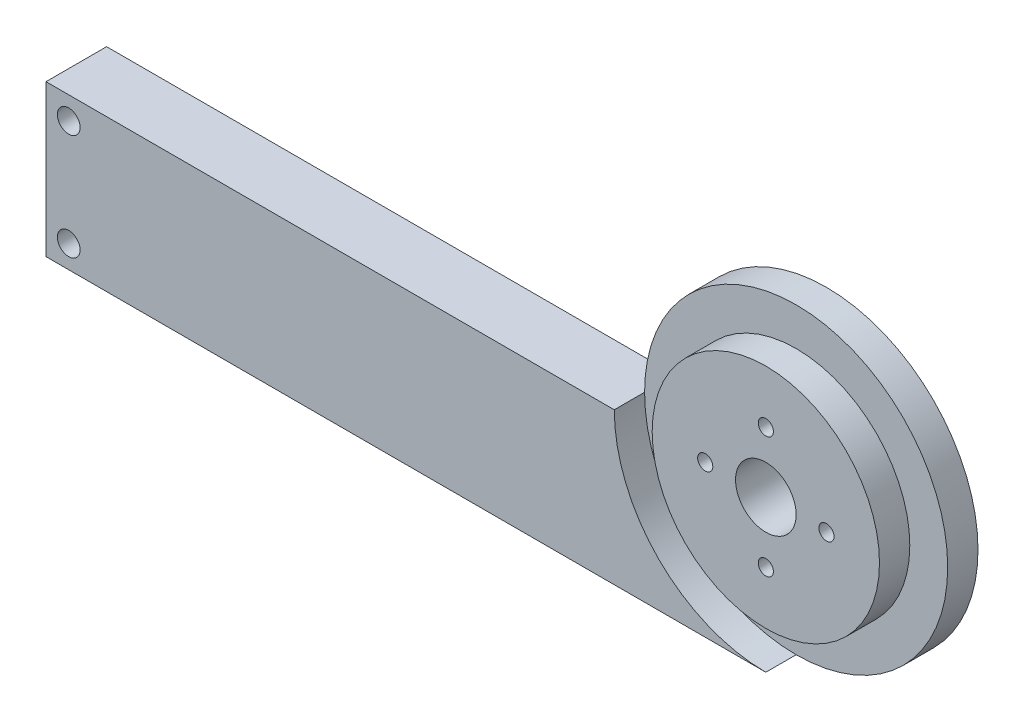
ISO-10303-21;
HEADER;
FILE_DESCRIPTION(('STEP AP214'),'2;1');
FILE_NAME('part.step','',(''),(''),'','','');
FILE_SCHEMA(('AUTOMOTIVE_DESIGN { 1 0 10303 214 1 1 1 1 }'));
ENDSEC;
DATA;
#1=APPLICATION_CONTEXT('core data for automotive mechanical design processes');
#2=APPLICATION_PROTOCOL_DEFINITION('international standard','automotive_design',2000,#1);
#3=PRODUCT_CONTEXT('',#1,'mechanical');
#4=PRODUCT('Part','Part','',(#3));
#5=PRODUCT_RELATED_PRODUCT_CATEGORY('part','',(#4));
#6=PRODUCT_DEFINITION_FORMATION('','',#4);
#7=PRODUCT_DEFINITION_CONTEXT('part definition',#1,'design');
#8=PRODUCT_DEFINITION('design','',#6,#7);
#9=PRODUCT_DEFINITION_SHAPE('','',#8);
#10=(LENGTH_UNIT() NAMED_UNIT(*) SI_UNIT(.MILLI.,.METRE.));
#11=(NAMED_UNIT(*) PLANE_ANGLE_UNIT() SI_UNIT($,.RADIAN.));
#12=(NAMED_UNIT(*) SI_UNIT($,.STERADIAN.) SOLID_ANGLE_UNIT());
#13=UNCERTAINTY_MEASURE_WITH_UNIT(LENGTH_MEASURE(1.E-05),#10,'distance_accuracy_value','');
#14=(GEOMETRIC_REPRESENTATION_CONTEXT(3) GLOBAL_UNCERTAINTY_ASSIGNED_CONTEXT((#13)) GLOBAL_UNIT_ASSIGNED_CONTEXT((#10,
#11,#12)) REPRESENTATION_CONTEXT('',''));
#15=CARTESIAN_POINT('',(0.,0.,0.));
#16=DIRECTION('',(0.,0.,1.));
#17=DIRECTION('',(1.,0.,0.));
#18=AXIS2_PLACEMENT_3D('',#15,#16,#17);
#19=CARTESIAN_POINT('',(32.9922327651456,28.0992721164614,8.));
#20=DIRECTION('',(0.,0.,-1.));
#21=DIRECTION('',(-1.,0.,0.));
#22=AXIS2_PLACEMENT_3D('',#19,#20,#21);
#23=CYLINDRICAL_SURFACE('',#22,20.);
#24=CARTESIAN_POINT('',(32.9922327651456,28.0992721164614,4.));
#25=DIRECTION('',(0.,0.,1.));
#26=DIRECTION('',(1.,0.,0.));
#27=AXIS2_PLACEMENT_3D('',#24,#25,#26);
#28=CIRCLE('',#27,20.);
#29=CARTESIAN_POINT('',(32.9922327651456,8.09927211646137,4.));
#30=VERTEX_POINT('',#29);
#31=CARTESIAN_POINT('',(12.9922327651456,28.0992721164614,4.));
#32=VERTEX_POINT('',#31);
#33=EDGE_CURVE('E124',#30,#32,#28,.T.);
#34=ORIENTED_EDGE('',*,*,#33,.F.);
#35=DIRECTION('',(0.,0.,-1.));
#36=VECTOR('',#35,1.);
#37=CARTESIAN_POINT('',(32.9922327651456,8.09927211646137,8.));
#38=LINE('',#37,#36);
#39=CARTESIAN_POINT('',(32.9922327651456,8.09927211646137,0.));
#40=VERTEX_POINT('',#39);
#41=EDGE_CURVE('E130',#30,#40,#38,.T.);
#42=ORIENTED_EDGE('',*,*,#41,.T.);
#43=CARTESIAN_POINT('',(32.9922327651456,28.0992721164614,0.));
#44=DIRECTION('',(0.,0.,1.));
#45=DIRECTION('',(1.,0.,0.));
#46=AXIS2_PLACEMENT_3D('',#43,#44,#45);
#47=CIRCLE('',#46,20.);
#48=CARTESIAN_POINT('',(12.9922327651456,28.0992721164614,0.));
#49=VERTEX_POINT('',#48);
#50=EDGE_CURVE('E95',#40,#49,#47,.T.);
#51=ORIENTED_EDGE('',*,*,#50,.T.);
#52=DIRECTION('',(0.,0.,-1.));
#53=VECTOR('',#52,1.);
#54=CARTESIAN_POINT('',(12.9922327651456,28.0992721164614,8.));
#55=LINE('',#54,#53);
#56=EDGE_CURVE('E44',#32,#49,#55,.T.);
#57=ORIENTED_EDGE('',*,*,#56,.F.);
#58=EDGE_LOOP('',(#34,#42,#51,#57));
#59=FACE_BOUND('',#58,.T.);
#60=ADVANCED_FACE('F35',(#59),#23,.T.);
#61=CARTESIAN_POINT('',(0.,28.0992721164614,8.));
#62=DIRECTION('',(0.,1.,0.));
#63=DIRECTION('',(0.,0.,1.));
#64=AXIS2_PLACEMENT_3D('',#61,#62,#63);
#65=PLANE('',#64);
#66=DIRECTION('',(1.,0.,0.));
#67=VECTOR('',#66,1.);
#68=CARTESIAN_POINT('',(0.,28.0992721164614,0.));
#69=LINE('',#68,#67);
#70=CARTESIAN_POINT('',(-62.0027952303751,28.0992721164614,0.));
#71=VERTEX_POINT('',#70);
#72=EDGE_CURVE('E85',#71,#49,#69,.T.);
#73=ORIENTED_EDGE('',*,*,#72,.F.);
#74=DIRECTION('',(0.,0.,1.));
#75=VECTOR('',#74,1.);
#76=CARTESIAN_POINT('',(-62.0027952303751,28.0992721164614,0.));
#77=LINE('',#76,#75);
#78=CARTESIAN_POINT('',(-62.0027952303751,28.0992721164614,8.));
#79=VERTEX_POINT('',#78);
#80=EDGE_CURVE('E89',#71,#79,#77,.T.);
#81=ORIENTED_EDGE('',*,*,#80,.T.);
#82=DIRECTION('',(1.,0.,0.));
#83=VECTOR('',#82,1.);
#84=CARTESIAN_POINT('',(0.,28.0992721164614,8.));
#85=LINE('',#84,#83);
#86=CARTESIAN_POINT('',(12.9922327651456,28.0992721164614,8.));
#87=VERTEX_POINT('',#86);
#88=EDGE_CURVE('E126',#79,#87,#85,.T.);
#89=ORIENTED_EDGE('',*,*,#88,.T.);
#90=EDGE_CURVE('E11',#87,#32,#55,.T.);
#91=ORIENTED_EDGE('',*,*,#90,.T.);
#92=ORIENTED_EDGE('',*,*,#56,.T.);
#93=EDGE_LOOP('',(#73,#81,#89,#91,#92));
#94=FACE_BOUND('',#93,.T.);
#95=ADVANCED_FACE('F87',(#94),#65,.T.);
#96=CARTESIAN_POINT('',(0.,8.09927211646137,8.));
#97=DIRECTION('',(0.,1.,0.));
#98=DIRECTION('',(0.,0.,1.));
#99=AXIS2_PLACEMENT_3D('',#96,#97,#98);
#100=PLANE('',#99);
#101=DIRECTION('',(1.,0.,0.));
#102=VECTOR('',#101,1.);
#103=CARTESIAN_POINT('',(0.,8.09927211646137,0.));
#104=LINE('',#103,#102);
#105=CARTESIAN_POINT('',(-62.0027952303751,8.09927211646137,0.));
#106=VERTEX_POINT('',#105);
#107=EDGE_CURVE('E94',#106,#40,#104,.T.);
#108=ORIENTED_EDGE('',*,*,#107,.T.);
#109=ORIENTED_EDGE('',*,*,#41,.F.);
#110=CARTESIAN_POINT('',(32.9922327651456,8.09927211646137,8.));
#111=VERTEX_POINT('',#110);
#112=EDGE_CURVE('E68',#111,#30,#38,.T.);
#113=ORIENTED_EDGE('',*,*,#112,.F.);
#114=DIRECTION('',(1.,0.,0.));
#115=VECTOR('',#114,1.);
#116=CARTESIAN_POINT('',(0.,8.09927211646137,8.));
#117=LINE('',#116,#115);
#118=CARTESIAN_POINT('',(-62.0027952303751,8.09927211646137,8.));
#119=VERTEX_POINT('',#118);
#120=EDGE_CURVE('E128',#119,#111,#117,.T.);
#121=ORIENTED_EDGE('',*,*,#120,.F.);
#122=DIRECTION('',(0.,0.,1.));
#123=VECTOR('',#122,1.);
#124=CARTESIAN_POINT('',(-62.0027952303751,8.09927211646137,0.));
#125=LINE('',#124,#123);
#126=EDGE_CURVE('E104',#106,#119,#125,.T.);
#127=ORIENTED_EDGE('',*,*,#126,.F.);
#128=EDGE_LOOP('',(#108,#109,#113,#121,#127));
#129=FACE_BOUND('',#128,.T.);
#130=ADVANCED_FACE('F195',(#129),#100,.F.);
#131=CARTESIAN_POINT('',(0.,0.,8.));
#132=DIRECTION('',(0.,0.,1.));
#133=DIRECTION('',(1.,0.,0.));
#134=AXIS2_PLACEMENT_3D('',#131,#132,#133);
#135=PLANE('',#134);
#136=CARTESIAN_POINT('',(-59.0027952303751,11.0992721164614,8.));
#137=DIRECTION('',(0.,0.,1.));
#138=DIRECTION('',(1.,0.,0.));
#139=AXIS2_PLACEMENT_3D('',#136,#137,#138);
#140=CIRCLE('',#139,1.5);
#141=CARTESIAN_POINT('',(-57.5027952303751,11.0992721164614,8.));
#142=VERTEX_POINT('',#141);
#143=EDGE_CURVE('E147',#142,#142,#140,.T.);
#144=ORIENTED_EDGE('',*,*,#143,.F.);
#145=EDGE_LOOP('',(#144));
#146=FACE_BOUND('',#145,.T.);
#147=CARTESIAN_POINT('',(-59.0027952303751,25.0992721164614,8.));
#148=DIRECTION('',(0.,0.,1.));
#149=DIRECTION('',(1.,0.,0.));
#150=AXIS2_PLACEMENT_3D('',#147,#148,#149);
#151=CIRCLE('',#150,1.5);
#152=CARTESIAN_POINT('',(-57.5027952303751,25.0992721164614,8.));
#153=VERTEX_POINT('',#152);
#154=EDGE_CURVE('E136',#153,#153,#151,.T.);
#155=ORIENTED_EDGE('',*,*,#154,.F.);
#156=EDGE_LOOP('',(#155));
#157=FACE_BOUND('',#156,.T.);
#158=CARTESIAN_POINT('',(32.9922327651456,28.0992721164614,8.));
#159=DIRECTION('',(0.,0.,1.));
#160=DIRECTION('',(1.,0.,0.));
#161=AXIS2_PLACEMENT_3D('',#158,#159,#160);
#162=CIRCLE('',#161,20.);
#163=EDGE_CURVE('E64',#87,#111,#162,.T.);
#164=ORIENTED_EDGE('',*,*,#163,.F.);
#165=ORIENTED_EDGE('',*,*,#88,.F.);
#166=DIRECTION('',(0.,-1.,0.));
#167=VECTOR('',#166,1.);
#168=CARTESIAN_POINT('',(-62.0027952303751,8.09927211646137,8.));
#169=LINE('',#168,#167);
#170=EDGE_CURVE('E103',#79,#119,#169,.T.);
#171=ORIENTED_EDGE('',*,*,#170,.T.);
#172=ORIENTED_EDGE('',*,*,#120,.T.);
#173=EDGE_LOOP('',(#164,#165,#171,#172));
#174=FACE_BOUND('',#173,.T.);
#175=ADVANCED_FACE('F201',(#146,#157,#174),#135,.T.);
#176=CARTESIAN_POINT('',(0.,0.,0.));
#177=DIRECTION('',(0.,0.,1.));
#178=DIRECTION('',(1.,0.,0.));
#179=AXIS2_PLACEMENT_3D('',#176,#177,#178);
#180=PLANE('',#179);
#181=CARTESIAN_POINT('',(-59.0027952303751,11.0992721164614,0.));
#182=DIRECTION('',(0.,0.,1.));
#183=DIRECTION('',(1.,0.,0.));
#184=AXIS2_PLACEMENT_3D('',#181,#182,#183);
#185=CIRCLE('',#184,1.5);
#186=CARTESIAN_POINT('',(-57.5027952303751,11.0992721164614,0.));
#187=VERTEX_POINT('',#186);
#188=EDGE_CURVE('E38',#187,#187,#185,.T.);
#189=ORIENTED_EDGE('',*,*,#188,.T.);
#190=EDGE_LOOP('',(#189));
#191=FACE_BOUND('',#190,.T.);
#192=CARTESIAN_POINT('',(-59.0027952303751,25.0992721164614,0.));
#193=DIRECTION('',(0.,0.,1.));
#194=DIRECTION('',(1.,0.,0.));
#195=AXIS2_PLACEMENT_3D('',#192,#193,#194);
#196=CIRCLE('',#195,1.5);
#197=CARTESIAN_POINT('',(-57.5027952303751,25.0992721164614,0.));
#198=VERTEX_POINT('',#197);
#199=EDGE_CURVE('E133',#198,#198,#196,.T.);
#200=ORIENTED_EDGE('',*,*,#199,.T.);
#201=EDGE_LOOP('',(#200));
#202=FACE_BOUND('',#201,.T.);
#203=CARTESIAN_POINT('',(32.9922327651456,28.0992721164614,0.));
#204=DIRECTION('',(0.,0.,1.));
#205=DIRECTION('',(1.,0.,0.));
#206=AXIS2_PLACEMENT_3D('',#203,#204,#205);
#207=CIRCLE('',#206,4.00000000000001);
#208=CARTESIAN_POINT('',(36.9922327651456,28.0992721164614,0.));
#209=VERTEX_POINT('',#208);
#210=EDGE_CURVE('E140',#209,#209,#207,.T.);
#211=ORIENTED_EDGE('',*,*,#210,.T.);
#212=EDGE_LOOP('',(#211));
#213=FACE_BOUND('',#212,.T.);
#214=CARTESIAN_POINT('',(32.9922327651456,36.0992721164614,0.));
#215=DIRECTION('',(0.,0.,1.));
#216=DIRECTION('',(1.,0.,0.));
#217=AXIS2_PLACEMENT_3D('',#214,#215,#216);
#218=CIRCLE('',#217,0.999999999999998);
#219=CARTESIAN_POINT('',(33.9922327651456,36.0992721164614,0.));
#220=VERTEX_POINT('',#219);
#221=EDGE_CURVE('E155',#220,#220,#218,.T.);
#222=ORIENTED_EDGE('',*,*,#221,.T.);
#223=EDGE_LOOP('',(#222));
#224=FACE_BOUND('',#223,.T.);
#225=CARTESIAN_POINT('',(24.9922327651456,28.0992721164614,0.));
#226=DIRECTION('',(0.,0.,1.));
#227=DIRECTION('',(1.,0.,0.));
#228=AXIS2_PLACEMENT_3D('',#225,#226,#227);
#229=CIRCLE('',#228,1.);
#230=CARTESIAN_POINT('',(25.9922327651456,28.0992721164614,0.));
#231=VERTEX_POINT('',#230);
#232=EDGE_CURVE('E161',#231,#231,#229,.T.);
#233=ORIENTED_EDGE('',*,*,#232,.T.);
#234=EDGE_LOOP('',(#233));
#235=FACE_BOUND('',#234,.T.);
#236=CARTESIAN_POINT('',(40.9922327651456,28.0992721164614,0.));
#237=DIRECTION('',(0.,0.,1.));
#238=DIRECTION('',(1.,0.,0.));
#239=AXIS2_PLACEMENT_3D('',#236,#237,#238);
#240=CIRCLE('',#239,0.999999999999998);
#241=CARTESIAN_POINT('',(41.9922327651456,28.0992721164614,0.));
#242=VERTEX_POINT('',#241);
#243=EDGE_CURVE('E167',#242,#242,#240,.T.);
#244=ORIENTED_EDGE('',*,*,#243,.T.);
#245=EDGE_LOOP('',(#244));
#246=FACE_BOUND('',#245,.T.);
#247=CARTESIAN_POINT('',(32.9922327651456,20.0992721164614,0.));
#248=DIRECTION('',(0.,0.,1.));
#249=DIRECTION('',(1.,0.,0.));
#250=AXIS2_PLACEMENT_3D('',#247,#248,#249);
#251=CIRCLE('',#250,0.999999999999998);
#252=CARTESIAN_POINT('',(33.9922327651456,20.0992721164614,0.));
#253=VERTEX_POINT('',#252);
#254=EDGE_CURVE('E110',#253,#253,#251,.T.);
#255=ORIENTED_EDGE('',*,*,#254,.T.);
#256=EDGE_LOOP('',(#255));
#257=FACE_BOUND('',#256,.T.);
#258=ORIENTED_EDGE('',*,*,#50,.F.);
#259=ORIENTED_EDGE('',*,*,#107,.F.);
#260=DIRECTION('',(0.,-1.,0.));
#261=VECTOR('',#260,1.);
#262=CARTESIAN_POINT('',(-62.0027952303751,8.09927211646137,0.));
#263=LINE('',#262,#261);
#264=EDGE_CURVE('E101',#71,#106,#263,.T.);
#265=ORIENTED_EDGE('',*,*,#264,.F.);
#266=ORIENTED_EDGE('',*,*,#72,.T.);
#267=EDGE_LOOP('',(#258,#259,#265,#266));
#268=FACE_BOUND('',#267,.T.);
#269=ADVANCED_FACE('F106',(#191,#202,#213,#224,#235,#246,#257,#268),#180,.F.);
#270=CARTESIAN_POINT('',(32.9922327651456,28.0992721164614,4.));
#271=DIRECTION('',(0.,0.,1.));
#272=DIRECTION('',(1.,0.,0.));
#273=AXIS2_PLACEMENT_3D('',#270,#271,#272);
#274=CYLINDRICAL_SURFACE('',#273,20.);
#275=ORIENTED_EDGE('',*,*,#90,.F.);
#276=ORIENTED_EDGE('',*,*,#163,.T.);
#277=ORIENTED_EDGE('',*,*,#112,.T.);
#278=EDGE_CURVE('E122',#32,#30,#28,.T.);
#279=ORIENTED_EDGE('',*,*,#278,.F.);
#280=EDGE_LOOP('',(#275,#276,#277,#279));
#281=FACE_BOUND('',#280,.T.);
#282=ADVANCED_FACE('F209',(#281),#274,.F.);
#283=CARTESIAN_POINT('',(32.9922327651456,28.0992721164614,4.));
#284=DIRECTION('',(0.,0.,1.));
#285=DIRECTION('',(1.,0.,0.));
#286=AXIS2_PLACEMENT_3D('',#283,#284,#285);
#287=PLANE('',#286);
#288=CARTESIAN_POINT('',(32.9922327651456,28.0992721164614,4.));
#289=DIRECTION('',(0.,0.,1.));
#290=DIRECTION('',(1.,0.,0.));
#291=AXIS2_PLACEMENT_3D('',#288,#289,#290);
#292=CIRCLE('',#291,15.);
#293=CARTESIAN_POINT('',(47.9922327651456,28.0992721164614,4.));
#294=VERTEX_POINT('',#293);
#295=EDGE_CURVE('E117',#294,#294,#292,.T.);
#296=ORIENTED_EDGE('',*,*,#295,.F.);
#297=EDGE_LOOP('',(#296));
#298=FACE_BOUND('',#297,.T.);
#299=ORIENTED_EDGE('',*,*,#278,.T.);
#300=ORIENTED_EDGE('',*,*,#33,.T.);
#301=EDGE_LOOP('',(#299,#300));
#302=FACE_BOUND('',#301,.T.);
#303=ADVANCED_FACE('F222',(#298,#302),#287,.T.);
#304=CARTESIAN_POINT('',(32.9922327651456,28.0992721164614,4.));
#305=DIRECTION('',(0.,0.,1.));
#306=DIRECTION('',(1.,0.,0.));
#307=AXIS2_PLACEMENT_3D('',#304,#305,#306);
#308=CYLINDRICAL_SURFACE('',#307,15.);
#309=ORIENTED_EDGE('',*,*,#295,.T.);
#310=EDGE_LOOP('',(#309));
#311=FACE_BOUND('',#310,.T.);
#312=CARTESIAN_POINT('',(32.9922327651456,28.0992721164614,8.));
#313=DIRECTION('',(0.,0.,1.));
#314=DIRECTION('',(1.,0.,0.));
#315=AXIS2_PLACEMENT_3D('',#312,#313,#314);
#316=CIRCLE('',#315,15.);
#317=CARTESIAN_POINT('',(47.9922327651456,28.0992721164614,8.));
#318=VERTEX_POINT('',#317);
#319=EDGE_CURVE('E115',#318,#318,#316,.T.);
#320=ORIENTED_EDGE('',*,*,#319,.F.);
#321=EDGE_LOOP('',(#320));
#322=FACE_BOUND('',#321,.T.);
#323=ADVANCED_FACE('F217',(#311,#322),#308,.T.);
#324=CARTESIAN_POINT('',(32.9922327651456,28.0992721164614,8.));
#325=DIRECTION('',(0.,0.,1.));
#326=DIRECTION('',(1.,0.,0.));
#327=AXIS2_PLACEMENT_3D('',#324,#325,#326);
#328=CIRCLE('',#327,4.00000000000001);
#329=CARTESIAN_POINT('',(36.9922327651456,28.0992721164614,8.));
#330=VERTEX_POINT('',#329);
#331=EDGE_CURVE('E135',#330,#330,#328,.T.);
#332=ORIENTED_EDGE('',*,*,#331,.F.);
#333=EDGE_LOOP('',(#332));
#334=FACE_BOUND('',#333,.T.);
#335=CARTESIAN_POINT('',(32.9922327651456,36.0992721164614,8.));
#336=DIRECTION('',(0.,0.,1.));
#337=DIRECTION('',(1.,0.,0.));
#338=AXIS2_PLACEMENT_3D('',#335,#336,#337);
#339=CIRCLE('',#338,0.999999999999998);
#340=CARTESIAN_POINT('',(33.9922327651456,36.0992721164614,8.));
#341=VERTEX_POINT('',#340);
#342=EDGE_CURVE('E152',#341,#341,#339,.T.);
#343=ORIENTED_EDGE('',*,*,#342,.F.);
#344=EDGE_LOOP('',(#343));
#345=FACE_BOUND('',#344,.T.);
#346=CARTESIAN_POINT('',(24.9922327651456,28.0992721164614,8.));
#347=DIRECTION('',(0.,0.,1.));
#348=DIRECTION('',(1.,0.,0.));
#349=AXIS2_PLACEMENT_3D('',#346,#347,#348);
#350=CIRCLE('',#349,1.);
#351=CARTESIAN_POINT('',(25.9922327651456,28.0992721164614,8.));
#352=VERTEX_POINT('',#351);
#353=EDGE_CURVE('E158',#352,#352,#350,.T.);
#354=ORIENTED_EDGE('',*,*,#353,.F.);
#355=EDGE_LOOP('',(#354));
#356=FACE_BOUND('',#355,.T.);
#357=CARTESIAN_POINT('',(40.9922327651456,28.0992721164614,8.));
#358=DIRECTION('',(0.,0.,1.));
#359=DIRECTION('',(1.,0.,0.));
#360=AXIS2_PLACEMENT_3D('',#357,#358,#359);
#361=CIRCLE('',#360,0.999999999999998);
#362=CARTESIAN_POINT('',(41.9922327651456,28.0992721164614,8.));
#363=VERTEX_POINT('',#362);
#364=EDGE_CURVE('E164',#363,#363,#361,.T.);
#365=ORIENTED_EDGE('',*,*,#364,.F.);
#366=EDGE_LOOP('',(#365));
#367=FACE_BOUND('',#366,.T.);
#368=CARTESIAN_POINT('',(32.9922327651456,20.0992721164614,8.));
#369=DIRECTION('',(0.,0.,1.));
#370=DIRECTION('',(1.,0.,0.));
#371=AXIS2_PLACEMENT_3D('',#368,#369,#370);
#372=CIRCLE('',#371,0.999999999999998);
#373=CARTESIAN_POINT('',(33.9922327651456,20.0992721164614,8.));
#374=VERTEX_POINT('',#373);
#375=EDGE_CURVE('E169',#374,#374,#372,.T.);
#376=ORIENTED_EDGE('',*,*,#375,.F.);
#377=EDGE_LOOP('',(#376));
#378=FACE_BOUND('',#377,.T.);
#379=ORIENTED_EDGE('',*,*,#319,.T.);
#380=EDGE_LOOP('',(#379));
#381=FACE_BOUND('',#380,.T.);
#382=ADVANCED_FACE('F188',(#334,#345,#356,#367,#378,#381),#135,.T.);
#383=CARTESIAN_POINT('',(-62.0027952303751,8.09927211646137,0.));
#384=DIRECTION('',(-1.,0.,0.));
#385=DIRECTION('',(0.,0.,1.));
#386=AXIS2_PLACEMENT_3D('',#383,#384,#385);
#387=PLANE('',#386);
#388=ORIENTED_EDGE('',*,*,#170,.F.);
#389=ORIENTED_EDGE('',*,*,#80,.F.);
#390=ORIENTED_EDGE('',*,*,#264,.T.);
#391=ORIENTED_EDGE('',*,*,#126,.T.);
#392=EDGE_LOOP('',(#388,#389,#390,#391));
#393=FACE_BOUND('',#392,.T.);
#394=ADVANCED_FACE('F99',(#393),#387,.T.);
#395=CARTESIAN_POINT('',(32.9922327651456,20.0992721164614,-2.));
#396=DIRECTION('',(0.,0.,1.));
#397=DIRECTION('',(1.,0.,0.));
#398=AXIS2_PLACEMENT_3D('',#395,#396,#397);
#399=CYLINDRICAL_SURFACE('',#398,0.999999999999998);
#400=ORIENTED_EDGE('',*,*,#375,.T.);
#401=EDGE_LOOP('',(#400));
#402=FACE_BOUND('',#401,.T.);
#403=ORIENTED_EDGE('',*,*,#254,.F.);
#404=EDGE_LOOP('',(#403));
#405=FACE_BOUND('',#404,.T.);
#406=ADVANCED_FACE('F177',(#402,#405),#399,.F.);
#407=CARTESIAN_POINT('',(40.9922327651456,28.0992721164614,-2.));
#408=DIRECTION('',(0.,0.,1.));
#409=DIRECTION('',(1.,0.,0.));
#410=AXIS2_PLACEMENT_3D('',#407,#408,#409);
#411=CYLINDRICAL_SURFACE('',#410,0.999999999999998);
#412=ORIENTED_EDGE('',*,*,#364,.T.);
#413=EDGE_LOOP('',(#412));
#414=FACE_BOUND('',#413,.T.);
#415=ORIENTED_EDGE('',*,*,#243,.F.);
#416=EDGE_LOOP('',(#415));
#417=FACE_BOUND('',#416,.T.);
#418=ADVANCED_FACE('F179',(#414,#417),#411,.F.);
#419=CARTESIAN_POINT('',(24.9922327651456,28.0992721164614,-2.));
#420=DIRECTION('',(0.,0.,1.));
#421=DIRECTION('',(1.,0.,0.));
#422=AXIS2_PLACEMENT_3D('',#419,#420,#421);
#423=CYLINDRICAL_SURFACE('',#422,1.);
#424=ORIENTED_EDGE('',*,*,#353,.T.);
#425=EDGE_LOOP('',(#424));
#426=FACE_BOUND('',#425,.T.);
#427=ORIENTED_EDGE('',*,*,#232,.F.);
#428=EDGE_LOOP('',(#427));
#429=FACE_BOUND('',#428,.T.);
#430=ADVANCED_FACE('F185',(#426,#429),#423,.F.);
#431=CARTESIAN_POINT('',(32.9922327651456,36.0992721164614,-2.));
#432=DIRECTION('',(0.,0.,1.));
#433=DIRECTION('',(1.,0.,0.));
#434=AXIS2_PLACEMENT_3D('',#431,#432,#433);
#435=CYLINDRICAL_SURFACE('',#434,0.999999999999998);
#436=ORIENTED_EDGE('',*,*,#342,.T.);
#437=EDGE_LOOP('',(#436));
#438=FACE_BOUND('',#437,.T.);
#439=ORIENTED_EDGE('',*,*,#221,.F.);
#440=EDGE_LOOP('',(#439));
#441=FACE_BOUND('',#440,.T.);
#442=ADVANCED_FACE('F242',(#438,#441),#435,.F.);
#443=CARTESIAN_POINT('',(32.9922327651456,28.0992721164614,-2.));
#444=DIRECTION('',(0.,0.,1.));
#445=DIRECTION('',(1.,0.,0.));
#446=AXIS2_PLACEMENT_3D('',#443,#444,#445);
#447=CYLINDRICAL_SURFACE('',#446,4.00000000000001);
#448=ORIENTED_EDGE('',*,*,#331,.T.);
#449=EDGE_LOOP('',(#448));
#450=FACE_BOUND('',#449,.T.);
#451=ORIENTED_EDGE('',*,*,#210,.F.);
#452=EDGE_LOOP('',(#451));
#453=FACE_BOUND('',#452,.T.);
#454=ADVANCED_FACE('F249',(#450,#453),#447,.F.);
#455=CARTESIAN_POINT('',(-59.0027952303751,25.0992721164614,-2.));
#456=DIRECTION('',(0.,0.,1.));
#457=DIRECTION('',(1.,0.,0.));
#458=AXIS2_PLACEMENT_3D('',#455,#456,#457);
#459=CYLINDRICAL_SURFACE('',#458,1.5);
#460=ORIENTED_EDGE('',*,*,#154,.T.);
#461=EDGE_LOOP('',(#460));
#462=FACE_BOUND('',#461,.T.);
#463=ORIENTED_EDGE('',*,*,#199,.F.);
#464=EDGE_LOOP('',(#463));
#465=FACE_BOUND('',#464,.T.);
#466=ADVANCED_FACE('F255',(#462,#465),#459,.F.);
#467=CARTESIAN_POINT('',(-59.0027952303751,11.0992721164614,-2.));
#468=DIRECTION('',(0.,0.,1.));
#469=DIRECTION('',(1.,0.,0.));
#470=AXIS2_PLACEMENT_3D('',#467,#468,#469);
#471=CYLINDRICAL_SURFACE('',#470,1.5);
#472=ORIENTED_EDGE('',*,*,#143,.T.);
#473=EDGE_LOOP('',(#472));
#474=FACE_BOUND('',#473,.T.);
#475=ORIENTED_EDGE('',*,*,#188,.F.);
#476=EDGE_LOOP('',(#475));
#477=FACE_BOUND('',#476,.T.);
#478=ADVANCED_FACE('F259',(#474,#477),#471,.F.);
#479=CLOSED_SHELL('',(#60,#95,#130,#175,#269,#282,#303,#323,#382,#394,#406,#418,#430,#442,#454,
#466,#478));
#480=MANIFOLD_SOLID_BREP('B2',#479);
#481=ADVANCED_BREP_SHAPE_REPRESENTATION('',(#18,#480),#14);
#482=SHAPE_DEFINITION_REPRESENTATION(#9,#481);
ENDSEC;
END-ISO-10303-21;
